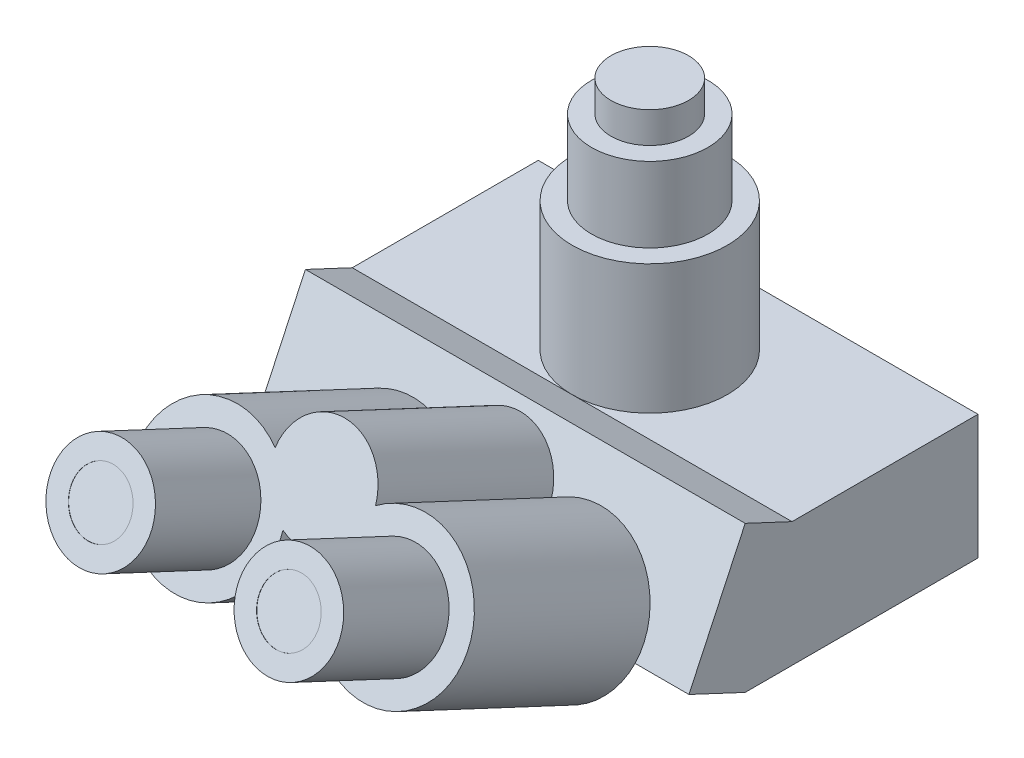
ISO-10303-21;
HEADER;
FILE_DESCRIPTION(('STEP AP214'),'2;1');
FILE_NAME('part.step','',(''),(''),'','','');
FILE_SCHEMA(('AUTOMOTIVE_DESIGN { 1 0 10303 214 1 1 1 1 }'));
ENDSEC;
DATA;
#1=APPLICATION_CONTEXT('core data for automotive mechanical design processes');
#2=APPLICATION_PROTOCOL_DEFINITION('international standard','automotive_design',2000,#1);
#3=PRODUCT_CONTEXT('',#1,'mechanical');
#4=PRODUCT('Part','Part','',(#3));
#5=PRODUCT_RELATED_PRODUCT_CATEGORY('part','',(#4));
#6=PRODUCT_DEFINITION_FORMATION('','',#4);
#7=PRODUCT_DEFINITION_CONTEXT('part definition',#1,'design');
#8=PRODUCT_DEFINITION('design','',#6,#7);
#9=PRODUCT_DEFINITION_SHAPE('','',#8);
#10=(LENGTH_UNIT() NAMED_UNIT(*) SI_UNIT(.MILLI.,.METRE.));
#11=(NAMED_UNIT(*) PLANE_ANGLE_UNIT() SI_UNIT($,.RADIAN.));
#12=(NAMED_UNIT(*) SI_UNIT($,.STERADIAN.) SOLID_ANGLE_UNIT());
#13=UNCERTAINTY_MEASURE_WITH_UNIT(LENGTH_MEASURE(1.E-05),#10,'distance_accuracy_value','');
#14=(GEOMETRIC_REPRESENTATION_CONTEXT(3) GLOBAL_UNCERTAINTY_ASSIGNED_CONTEXT((#13)) GLOBAL_UNIT_ASSIGNED_CONTEXT((#10,
#11,#12)) REPRESENTATION_CONTEXT('',''));
#15=CARTESIAN_POINT('',(0.,0.,0.));
#16=DIRECTION('',(0.,0.,1.));
#17=DIRECTION('',(1.,0.,0.));
#18=AXIS2_PLACEMENT_3D('',#15,#16,#17);
#19=CARTESIAN_POINT('',(-18.1865334794783,57.1587664374847,82.5526690406383));
#20=DIRECTION('',(0.,0.423992010428259,0.905665929078158));
#21=DIRECTION('',(0.,-0.905665929078158,0.423992010428259));
#22=AXIS2_PLACEMENT_3D('',#19,#20,#21);
#23=PLANE('',#22);
#24=CARTESIAN_POINT('',(36.3730669589503,47.6492741821735,87.0045851501307));
#25=DIRECTION('',(0.,0.423992010428259,0.905665929078158));
#26=DIRECTION('',(0.,-0.905665929078158,0.423992010428259));
#27=AXIS2_PLACEMENT_3D('',#24,#25,#26);
#28=CIRCLE('',#27,19.5);
#29=CARTESIAN_POINT('',(36.3730669589503,29.9887885651495,95.2724293534817));
#30=VERTEX_POINT('',#29);
#31=EDGE_CURVE('E284',#30,#30,#28,.T.);
#32=ORIENTED_EDGE('',*,*,#31,.F.);
#33=EDGE_LOOP('',(#32));
#34=FACE_BOUND('',#33,.T.);
#35=CARTESIAN_POINT('',(-36.3730669589422,47.6492741821607,87.0045851501366));
#36=DIRECTION('',(0.,0.423992010428259,0.905665929078158));
#37=DIRECTION('',(0.,-0.905665929078158,0.423992010428259));
#38=AXIS2_PLACEMENT_3D('',#35,#36,#37);
#39=CIRCLE('',#38,28.5);
#40=CARTESIAN_POINT('',(-19.4072154072409,68.3890216073841,77.2951692118057));
#41=VERTEX_POINT('',#40);
#42=CARTESIAN_POINT('',(-8.0581616842069,50.58622175999,85.6296385301244));
#43=VERTEX_POINT('',#42);
#44=EDGE_CURVE('E148',#41,#43,#39,.T.);
#45=ORIENTED_EDGE('',*,*,#44,.T.);
#46=CARTESIAN_POINT('',(-1.45543299634454E-11,66.6682586928087,78.1007529311401));
#47=DIRECTION('',(0.,0.423992010428259,0.905665929078158));
#48=DIRECTION('',(0.,-0.905665929078158,0.423992010428259));
#49=AXIS2_PLACEMENT_3D('',#46,#47,#48);
#50=CIRCLE('',#49,19.4999999999929);
#51=CARTESIAN_POINT('',(8.05816168421643,50.5862217600059,85.629638530117));
#52=VERTEX_POINT('',#51);
#53=EDGE_CURVE('E137',#43,#52,#50,.T.);
#54=ORIENTED_EDGE('',*,*,#53,.T.);
#55=CARTESIAN_POINT('',(36.3730669589503,47.6492741821735,87.0045851501306));
#56=DIRECTION('',(0.,0.423992010428259,0.905665929078158));
#57=DIRECTION('',(0.,-0.905665929078158,0.423992010428259));
#58=AXIS2_PLACEMENT_3D('',#55,#56,#57);
#59=CIRCLE('',#58,28.5000000000001);
#60=CARTESIAN_POINT('',(19.4072154072148,68.3890216073753,77.2951692118098));
#61=VERTEX_POINT('',#60);
#62=EDGE_CURVE('E147',#52,#61,#59,.T.);
#63=ORIENTED_EDGE('',*,*,#62,.T.);
#64=CARTESIAN_POINT('',(-1.45543299634454E-11,66.6682586928087,78.1007529311401));
#65=DIRECTION('',(0.,0.423992010428259,0.905665929078158));
#66=DIRECTION('',(0.,-0.905665929078158,0.423992010428259));
#67=AXIS2_PLACEMENT_3D('',#64,#65,#66);
#68=CIRCLE('',#67,19.4999999999876);
#69=EDGE_CURVE('E153',#61,#41,#68,.T.);
#70=ORIENTED_EDGE('',*,*,#69,.T.);
#71=EDGE_LOOP('',(#45,#54,#63,#70));
#72=FACE_BOUND('',#71,.T.);
#73=CARTESIAN_POINT('',(-36.3730669589422,47.6492741821607,87.0045851501367));
#74=DIRECTION('',(0.,0.423992010428259,0.905665929078158));
#75=DIRECTION('',(0.,-0.905665929078158,0.423992010428259));
#76=AXIS2_PLACEMENT_3D('',#73,#74,#75);
#77=CIRCLE('',#76,19.5);
#78=CARTESIAN_POINT('',(-36.3730669589422,29.9887885651366,95.2724293534877));
#79=VERTEX_POINT('',#78);
#80=EDGE_CURVE('E11',#79,#79,#77,.T.);
#81=ORIENTED_EDGE('',*,*,#80,.F.);
#82=EDGE_LOOP('',(#81));
#83=FACE_BOUND('',#82,.T.);
#84=ADVANCED_FACE('F45',(#34,#72,#83),#23,.T.);
#85=CARTESIAN_POINT('',(85.,56.6048402085651,0.));
#86=DIRECTION('',(0.,-0.423992010428259,-0.905665929078158));
#87=DIRECTION('',(0.,0.905665929078158,-0.423992010428259));
#88=AXIS2_PLACEMENT_3D('',#85,#86,#87);
#89=PLANE('',#88);
#90=CARTESIAN_POINT('',(-36.3730669589422,15.8498734000413,19.0796404692748));
#91=DIRECTION('',(0.,0.423992010428259,0.905665929078158));
#92=DIRECTION('',(0.,-0.905665929078158,0.423992010428259));
#93=AXIS2_PLACEMENT_3D('',#90,#91,#92);
#94=CIRCLE('',#93,28.5);
#95=CARTESIAN_POINT('',(-19.4072154072409,36.5896208252646,9.37022453094387));
#96=VERTEX_POINT('',#95);
#97=CARTESIAN_POINT('',(-64.1759235166031,10.1758082502781,21.7359822978757));
#98=VERTEX_POINT('',#97);
#99=EDGE_CURVE('E62',#96,#98,#94,.T.);
#100=ORIENTED_EDGE('',*,*,#99,.F.);
#101=CARTESIAN_POINT('',(-1.45543299634454E-11,34.8688579106893,10.1758082502782));
#102=DIRECTION('',(0.,0.423992010428259,0.905665929078158));
#103=DIRECTION('',(0.,-0.905665929078158,0.423992010428259));
#104=AXIS2_PLACEMENT_3D('',#101,#102,#103);
#105=CIRCLE('',#104,19.4999999999876);
#106=CARTESIAN_POINT('',(19.4072154072148,36.5896208252558,9.37022453094798));
#107=VERTEX_POINT('',#106);
#108=EDGE_CURVE('E66',#107,#96,#105,.T.);
#109=ORIENTED_EDGE('',*,*,#108,.F.);
#110=CARTESIAN_POINT('',(36.3730669589503,15.8498734000541,19.0796404692688));
#111=DIRECTION('',(0.,0.423992010428259,0.905665929078158));
#112=DIRECTION('',(0.,-0.905665929078158,0.423992010428259));
#113=AXIS2_PLACEMENT_3D('',#110,#111,#112);
#114=CIRCLE('',#113,28.5000000000001);
#115=CARTESIAN_POINT('',(64.1759235166082,10.1758082502781,21.7359822978757));
#116=VERTEX_POINT('',#115);
#117=EDGE_CURVE('E54',#116,#107,#114,.T.);
#118=ORIENTED_EDGE('',*,*,#117,.F.);
#119=DIRECTION('',(-1.,0.,0.));
#120=VECTOR('',#119,1.);
#121=CARTESIAN_POINT('',(85.,10.1758082502781,21.7359822978757));
#122=LINE('',#121,#120);
#123=CARTESIAN_POINT('',(85.,10.1758082502781,21.7359822978757));
#124=VERTEX_POINT('',#123);
#125=EDGE_CURVE('E214',#124,#116,#122,.T.);
#126=ORIENTED_EDGE('',*,*,#125,.F.);
#127=DIRECTION('',(0.,-0.905665929078158,0.423992010428259));
#128=VECTOR('',#127,1.);
#129=CARTESIAN_POINT('',(85.,56.6048402085651,0.));
#130=LINE('',#129,#128);
#131=CARTESIAN_POINT('',(85.,56.6048402085651,0.));
#132=VERTEX_POINT('',#131);
#133=EDGE_CURVE('E198',#132,#124,#130,.T.);
#134=ORIENTED_EDGE('',*,*,#133,.F.);
#135=DIRECTION('',(-1.,0.,0.));
#136=VECTOR('',#135,1.);
#137=CARTESIAN_POINT('',(85.,56.6048402085651,0.));
#138=LINE('',#137,#136);
#139=CARTESIAN_POINT('',(-85.,56.6048402085651,0.));
#140=VERTEX_POINT('',#139);
#141=EDGE_CURVE('E217',#132,#140,#138,.T.);
#142=ORIENTED_EDGE('',*,*,#141,.T.);
#143=DIRECTION('',(0.,-0.905665929078158,0.423992010428259));
#144=VECTOR('',#143,1.);
#145=CARTESIAN_POINT('',(-85.,56.6048402085651,0.));
#146=LINE('',#145,#144);
#147=CARTESIAN_POINT('',(-85.,10.1758082502781,21.7359822978757));
#148=VERTEX_POINT('',#147);
#149=EDGE_CURVE('E190',#140,#148,#146,.T.);
#150=ORIENTED_EDGE('',*,*,#149,.T.);
#151=EDGE_CURVE('E200',#98,#148,#122,.T.);
#152=ORIENTED_EDGE('',*,*,#151,.F.);
#153=EDGE_LOOP('',(#100,#109,#118,#126,#134,#142,#150,#152));
#154=FACE_BOUND('',#153,.T.);
#155=ADVANCED_FACE('F314',(#154),#89,.F.);
#156=CARTESIAN_POINT('',(85.,10.1758082502781,21.7359822978757));
#157=DIRECTION('',(0.,0.905665929078159,-0.423992010428257));
#158=DIRECTION('',(0.,0.423992010428257,0.905665929078159));
#159=AXIS2_PLACEMENT_3D('',#156,#157,#158);
#160=PLANE('',#159);
#161=DIRECTION('',(0.,-0.423992010428257,-0.905665929078159));
#162=VECTOR('',#161,1.);
#163=CARTESIAN_POINT('',(-85.,10.1758082502781,21.7359822978757));
#164=LINE('',#163,#162);
#165=CARTESIAN_POINT('',(-85.,0.,0.));
#166=VERTEX_POINT('',#165);
#167=EDGE_CURVE('E183',#148,#166,#164,.T.);
#168=ORIENTED_EDGE('',*,*,#167,.T.);
#169=DIRECTION('',(-1.,0.,0.));
#170=VECTOR('',#169,1.);
#171=CARTESIAN_POINT('',(85.,0.,0.));
#172=LINE('',#171,#170);
#173=CARTESIAN_POINT('',(85.,0.,0.));
#174=VERTEX_POINT('',#173);
#175=EDGE_CURVE('E49',#174,#166,#172,.T.);
#176=ORIENTED_EDGE('',*,*,#175,.F.);
#177=DIRECTION('',(0.,-0.423992010428257,-0.905665929078159));
#178=VECTOR('',#177,1.);
#179=CARTESIAN_POINT('',(85.,10.1758082502781,21.7359822978757));
#180=LINE('',#179,#178);
#181=EDGE_CURVE('E186',#124,#174,#180,.T.);
#182=ORIENTED_EDGE('',*,*,#181,.F.);
#183=ORIENTED_EDGE('',*,*,#125,.T.);
#184=CARTESIAN_POINT('',(8.57021040129247,10.1758082502781,21.7359822978757));
#185=VERTEX_POINT('',#184);
#186=EDGE_CURVE('E218',#116,#185,#122,.T.);
#187=ORIENTED_EDGE('',*,*,#186,.T.);
#188=CARTESIAN_POINT('',(-8.57021040128124,10.1758082502781,21.7359822978757));
#189=VERTEX_POINT('',#188);
#190=EDGE_CURVE('E268',#185,#189,#122,.T.);
#191=ORIENTED_EDGE('',*,*,#190,.T.);
#192=EDGE_CURVE('E637',#189,#98,#122,.T.);
#193=ORIENTED_EDGE('',*,*,#192,.T.);
#194=ORIENTED_EDGE('',*,*,#151,.T.);
#195=EDGE_LOOP('',(#168,#176,#182,#183,#187,#191,#193,#194));
#196=FACE_BOUND('',#195,.T.);
#197=ADVANCED_FACE('F47',(#196),#160,.F.);
#198=CARTESIAN_POINT('',(85.,0.,0.));
#199=DIRECTION('',(0.,1.,0.));
#200=DIRECTION('',(0.,0.,1.));
#201=AXIS2_PLACEMENT_3D('',#198,#199,#200);
#202=PLANE('',#201);
#203=DIRECTION('',(0.,0.,-1.));
#204=VECTOR('',#203,1.);
#205=CARTESIAN_POINT('',(-85.,0.,0.));
#206=LINE('',#205,#204);
#207=CARTESIAN_POINT('',(-85.,0.,-90.));
#208=VERTEX_POINT('',#207);
#209=EDGE_CURVE('E203',#166,#208,#206,.T.);
#210=ORIENTED_EDGE('',*,*,#209,.T.);
#211=DIRECTION('',(-1.,0.,0.));
#212=VECTOR('',#211,1.);
#213=CARTESIAN_POINT('',(85.,0.,-90.));
#214=LINE('',#213,#212);
#215=CARTESIAN_POINT('',(85.,0.,-90.));
#216=VERTEX_POINT('',#215);
#217=EDGE_CURVE('E226',#216,#208,#214,.T.);
#218=ORIENTED_EDGE('',*,*,#217,.F.);
#219=DIRECTION('',(0.,0.,-1.));
#220=VECTOR('',#219,1.);
#221=CARTESIAN_POINT('',(85.,0.,0.));
#222=LINE('',#221,#220);
#223=EDGE_CURVE('E189',#174,#216,#222,.T.);
#224=ORIENTED_EDGE('',*,*,#223,.F.);
#225=ORIENTED_EDGE('',*,*,#175,.T.);
#226=EDGE_LOOP('',(#210,#218,#224,#225));
#227=FACE_BOUND('',#226,.T.);
#228=ADVANCED_FACE('F235',(#227),#202,.F.);
#229=CARTESIAN_POINT('',(85.,0.,-90.));
#230=DIRECTION('',(0.,0.,1.));
#231=DIRECTION('',(1.,0.,0.));
#232=AXIS2_PLACEMENT_3D('',#229,#230,#231);
#233=PLANE('',#232);
#234=DIRECTION('',(0.,1.,0.));
#235=VECTOR('',#234,1.);
#236=CARTESIAN_POINT('',(-85.,0.,-90.));
#237=LINE('',#236,#235);
#238=CARTESIAN_POINT('',(-85.,48.125,-90.));
#239=VERTEX_POINT('',#238);
#240=EDGE_CURVE('E205',#208,#239,#237,.T.);
#241=ORIENTED_EDGE('',*,*,#240,.T.);
#242=DIRECTION('',(-1.,0.,0.));
#243=VECTOR('',#242,1.);
#244=CARTESIAN_POINT('',(85.,48.125,-90.));
#245=LINE('',#244,#243);
#246=CARTESIAN_POINT('',(85.,48.125,-90.));
#247=VERTEX_POINT('',#246);
#248=EDGE_CURVE('E224',#247,#239,#245,.T.);
#249=ORIENTED_EDGE('',*,*,#248,.F.);
#250=DIRECTION('',(0.,1.,0.));
#251=VECTOR('',#250,1.);
#252=CARTESIAN_POINT('',(85.,0.,-90.));
#253=LINE('',#252,#251);
#254=EDGE_CURVE('E192',#216,#247,#253,.T.);
#255=ORIENTED_EDGE('',*,*,#254,.F.);
#256=ORIENTED_EDGE('',*,*,#217,.T.);
#257=EDGE_LOOP('',(#241,#249,#255,#256));
#258=FACE_BOUND('',#257,.T.);
#259=ADVANCED_FACE('F246',(#258),#233,.F.);
#260=CARTESIAN_POINT('',(85.,48.125,-90.));
#261=DIRECTION('',(0.,-1.,0.));
#262=DIRECTION('',(0.,0.,-1.));
#263=AXIS2_PLACEMENT_3D('',#260,#261,#262);
#264=PLANE('',#263);
#265=DIRECTION('',(-1.,0.,0.));
#266=VECTOR('',#265,1.);
#267=CARTESIAN_POINT('',(85.,48.125,-18.1133185815631));
#268=LINE('',#267,#266);
#269=CARTESIAN_POINT('',(0.,48.125,-18.1133185815631));
#270=VERTEX_POINT('',#269);
#271=CARTESIAN_POINT('',(-85.,48.125,-18.1133185815631));
#272=VERTEX_POINT('',#271);
#273=EDGE_CURVE('E221',#270,#272,#268,.T.);
#274=ORIENTED_EDGE('',*,*,#273,.F.);
#275=CARTESIAN_POINT('',(0.,48.125,-48.1133185815631));
#276=DIRECTION('',(0.,1.,0.));
#277=DIRECTION('',(0.,0.,1.));
#278=AXIS2_PLACEMENT_3D('',#275,#276,#277);
#279=CIRCLE('',#278,30.);
#280=EDGE_CURVE('E177',#270,#270,#279,.T.);
#281=ORIENTED_EDGE('',*,*,#280,.F.);
#282=CARTESIAN_POINT('',(85.,48.125,-18.1133185815631));
#283=VERTEX_POINT('',#282);
#284=EDGE_CURVE('E222',#283,#270,#268,.T.);
#285=ORIENTED_EDGE('',*,*,#284,.F.);
#286=DIRECTION('',(0.,0.,1.));
#287=VECTOR('',#286,1.);
#288=CARTESIAN_POINT('',(85.,48.125,-90.));
#289=LINE('',#288,#287);
#290=EDGE_CURVE('E194',#247,#283,#289,.T.);
#291=ORIENTED_EDGE('',*,*,#290,.F.);
#292=ORIENTED_EDGE('',*,*,#248,.T.);
#293=DIRECTION('',(0.,0.,1.));
#294=VECTOR('',#293,1.);
#295=CARTESIAN_POINT('',(-85.,48.125,-90.));
#296=LINE('',#295,#294);
#297=EDGE_CURVE('E207',#239,#272,#296,.T.);
#298=ORIENTED_EDGE('',*,*,#297,.T.);
#299=EDGE_LOOP('',(#274,#281,#285,#291,#292,#298));
#300=FACE_BOUND('',#299,.T.);
#301=ADVANCED_FACE('F250',(#300),#264,.F.);
#302=CARTESIAN_POINT('',(85.,48.125,-18.1133185815631));
#303=DIRECTION('',(0.,-0.905665929078159,0.423992010428257));
#304=DIRECTION('',(0.,-0.423992010428257,-0.905665929078159));
#305=AXIS2_PLACEMENT_3D('',#302,#303,#304);
#306=PLANE('',#305);
#307=DIRECTION('',(0.,0.423992010428257,0.905665929078159));
#308=VECTOR('',#307,1.);
#309=CARTESIAN_POINT('',(-85.,48.125,-18.1133185815631));
#310=LINE('',#309,#308);
#311=EDGE_CURVE('E210',#272,#140,#310,.T.);
#312=ORIENTED_EDGE('',*,*,#311,.T.);
#313=ORIENTED_EDGE('',*,*,#141,.F.);
#314=DIRECTION('',(0.,0.423992010428257,0.905665929078159));
#315=VECTOR('',#314,1.);
#316=CARTESIAN_POINT('',(85.,48.125,-18.1133185815631));
#317=LINE('',#316,#315);
#318=EDGE_CURVE('E196',#283,#132,#317,.T.);
#319=ORIENTED_EDGE('',*,*,#318,.F.);
#320=ORIENTED_EDGE('',*,*,#284,.T.);
#321=ORIENTED_EDGE('',*,*,#273,.T.);
#322=EDGE_LOOP('',(#312,#313,#319,#320,#321));
#323=FACE_BOUND('',#322,.T.);
#324=ADVANCED_FACE('F567',(#323),#306,.F.);
#325=CARTESIAN_POINT('',(-8.0581616842069,18.7868209778706,17.7046938492626));
#326=VERTEX_POINT('',#325);
#327=EDGE_CURVE('E161',#189,#326,#94,.T.);
#328=ORIENTED_EDGE('',*,*,#327,.F.);
#329=ORIENTED_EDGE('',*,*,#190,.F.);
#330=CARTESIAN_POINT('',(8.05816168421643,18.7868209778865,17.7046938492551));
#331=VERTEX_POINT('',#330);
#332=EDGE_CURVE('E273',#331,#185,#114,.T.);
#333=ORIENTED_EDGE('',*,*,#332,.F.);
#334=CARTESIAN_POINT('',(-1.45543299634454E-11,34.8688579106893,10.1758082502782));
#335=DIRECTION('',(0.,0.423992010428259,0.905665929078158));
#336=DIRECTION('',(0.,-0.905665929078158,0.423992010428259));
#337=AXIS2_PLACEMENT_3D('',#334,#335,#336);
#338=CIRCLE('',#337,19.4999999999929);
#339=EDGE_CURVE('E274',#326,#331,#338,.T.);
#340=ORIENTED_EDGE('',*,*,#339,.F.);
#341=EDGE_LOOP('',(#328,#329,#333,#340));
#342=FACE_BOUND('',#341,.T.);
#343=ADVANCED_FACE('F322',(#342),#89,.F.);
#344=CARTESIAN_POINT('',(85.,0.,0.));
#345=DIRECTION('',(-1.,0.,0.));
#346=DIRECTION('',(0.,0.,1.));
#347=AXIS2_PLACEMENT_3D('',#344,#345,#346);
#348=PLANE('',#347);
#349=ORIENTED_EDGE('',*,*,#181,.T.);
#350=ORIENTED_EDGE('',*,*,#223,.T.);
#351=ORIENTED_EDGE('',*,*,#254,.T.);
#352=ORIENTED_EDGE('',*,*,#290,.T.);
#353=ORIENTED_EDGE('',*,*,#318,.T.);
#354=ORIENTED_EDGE('',*,*,#133,.T.);
#355=EDGE_LOOP('',(#349,#350,#351,#352,#353,#354));
#356=FACE_BOUND('',#355,.T.);
#357=ADVANCED_FACE('F255',(#356),#348,.F.);
#358=CARTESIAN_POINT('',(-85.,0.,0.));
#359=DIRECTION('',(-1.,0.,0.));
#360=DIRECTION('',(0.,0.,1.));
#361=AXIS2_PLACEMENT_3D('',#358,#359,#360);
#362=PLANE('',#361);
#363=ORIENTED_EDGE('',*,*,#167,.F.);
#364=ORIENTED_EDGE('',*,*,#149,.F.);
#365=ORIENTED_EDGE('',*,*,#311,.F.);
#366=ORIENTED_EDGE('',*,*,#297,.F.);
#367=ORIENTED_EDGE('',*,*,#240,.F.);
#368=ORIENTED_EDGE('',*,*,#209,.F.);
#369=EDGE_LOOP('',(#363,#364,#365,#366,#367,#368));
#370=FACE_BOUND('',#369,.T.);
#371=ADVANCED_FACE('F242',(#370),#362,.T.);
#372=CARTESIAN_POINT('',(0.,98.125,-48.1133185815631));
#373=DIRECTION('',(0.,-1.,0.));
#374=DIRECTION('',(0.,0.,-1.));
#375=AXIS2_PLACEMENT_3D('',#372,#373,#374);
#376=CYLINDRICAL_SURFACE('',#375,30.);
#377=CARTESIAN_POINT('',(0.,98.125,-48.1133185815631));
#378=DIRECTION('',(0.,1.,0.));
#379=DIRECTION('',(0.,0.,1.));
#380=AXIS2_PLACEMENT_3D('',#377,#378,#379);
#381=CIRCLE('',#380,30.);
#382=CARTESIAN_POINT('',(0.,98.125,-18.1133185815631));
#383=VERTEX_POINT('',#382);
#384=EDGE_CURVE('E180',#383,#383,#381,.T.);
#385=ORIENTED_EDGE('',*,*,#384,.F.);
#386=EDGE_LOOP('',(#385));
#387=FACE_BOUND('',#386,.T.);
#388=ORIENTED_EDGE('',*,*,#280,.T.);
#389=EDGE_LOOP('',(#388));
#390=FACE_BOUND('',#389,.T.);
#391=ADVANCED_FACE('F527',(#387,#390),#376,.T.);
#392=CARTESIAN_POINT('',(0.,98.125,-48.1133185815631));
#393=DIRECTION('',(0.,1.,0.));
#394=DIRECTION('',(0.,0.,1.));
#395=AXIS2_PLACEMENT_3D('',#392,#393,#394);
#396=PLANE('',#395);
#397=CARTESIAN_POINT('',(0.,98.125,-48.1133185815631));
#398=DIRECTION('',(0.,1.,0.));
#399=DIRECTION('',(0.,0.,1.));
#400=AXIS2_PLACEMENT_3D('',#397,#398,#399);
#401=CIRCLE('',#400,22.5);
#402=CARTESIAN_POINT('',(0.,98.125,-25.6133185815631));
#403=VERTEX_POINT('',#402);
#404=EDGE_CURVE('E174',#403,#403,#401,.T.);
#405=ORIENTED_EDGE('',*,*,#404,.F.);
#406=EDGE_LOOP('',(#405));
#407=FACE_BOUND('',#406,.T.);
#408=ORIENTED_EDGE('',*,*,#384,.T.);
#409=EDGE_LOOP('',(#408));
#410=FACE_BOUND('',#409,.T.);
#411=ADVANCED_FACE('F517',(#407,#410),#396,.T.);
#412=CARTESIAN_POINT('',(0.,127.125,-48.1133185815631));
#413=DIRECTION('',(0.,-1.,0.));
#414=DIRECTION('',(0.,0.,-1.));
#415=AXIS2_PLACEMENT_3D('',#412,#413,#414);
#416=CYLINDRICAL_SURFACE('',#415,22.5);
#417=CARTESIAN_POINT('',(0.,127.125,-48.1133185815631));
#418=DIRECTION('',(0.,1.,0.));
#419=DIRECTION('',(0.,0.,1.));
#420=AXIS2_PLACEMENT_3D('',#417,#418,#419);
#421=CIRCLE('',#420,22.5);
#422=CARTESIAN_POINT('',(0.,127.125,-25.6133185815631));
#423=VERTEX_POINT('',#422);
#424=EDGE_CURVE('E165',#423,#423,#421,.T.);
#425=ORIENTED_EDGE('',*,*,#424,.F.);
#426=EDGE_LOOP('',(#425));
#427=FACE_BOUND('',#426,.T.);
#428=ORIENTED_EDGE('',*,*,#404,.T.);
#429=EDGE_LOOP('',(#428));
#430=FACE_BOUND('',#429,.T.);
#431=ADVANCED_FACE('F507',(#427,#430),#416,.T.);
#432=CARTESIAN_POINT('',(0.,127.125,-48.1133185815631));
#433=DIRECTION('',(0.,1.,0.));
#434=DIRECTION('',(0.,0.,1.));
#435=AXIS2_PLACEMENT_3D('',#432,#433,#434);
#436=PLANE('',#435);
#437=CARTESIAN_POINT('',(0.,127.125,-48.1133185815631));
#438=DIRECTION('',(0.,1.,0.));
#439=DIRECTION('',(0.,0.,1.));
#440=AXIS2_PLACEMENT_3D('',#437,#438,#439);
#441=CIRCLE('',#440,15.);
#442=CARTESIAN_POINT('',(0.,127.125,-33.1133185815631));
#443=VERTEX_POINT('',#442);
#444=EDGE_CURVE('E171',#443,#443,#441,.T.);
#445=ORIENTED_EDGE('',*,*,#444,.F.);
#446=EDGE_LOOP('',(#445));
#447=FACE_BOUND('',#446,.T.);
#448=ORIENTED_EDGE('',*,*,#424,.T.);
#449=EDGE_LOOP('',(#448));
#450=FACE_BOUND('',#449,.T.);
#451=ADVANCED_FACE('F497',(#447,#450),#436,.T.);
#452=CARTESIAN_POINT('',(0.,139.125,-48.1133185815631));
#453=DIRECTION('',(0.,-1.,0.));
#454=DIRECTION('',(0.,0.,-1.));
#455=AXIS2_PLACEMENT_3D('',#452,#453,#454);
#456=CYLINDRICAL_SURFACE('',#455,15.);
#457=CARTESIAN_POINT('',(0.,139.125,-48.1133185815631));
#458=DIRECTION('',(0.,1.,0.));
#459=DIRECTION('',(0.,0.,1.));
#460=AXIS2_PLACEMENT_3D('',#457,#458,#459);
#461=CIRCLE('',#460,15.);
#462=CARTESIAN_POINT('',(0.,139.125,-33.1133185815631));
#463=VERTEX_POINT('',#462);
#464=EDGE_CURVE('E162',#463,#463,#461,.T.);
#465=ORIENTED_EDGE('',*,*,#464,.F.);
#466=EDGE_LOOP('',(#465));
#467=FACE_BOUND('',#466,.T.);
#468=ORIENTED_EDGE('',*,*,#444,.T.);
#469=EDGE_LOOP('',(#468));
#470=FACE_BOUND('',#469,.T.);
#471=ADVANCED_FACE('F487',(#467,#470),#456,.T.);
#472=CARTESIAN_POINT('',(0.,139.125,-48.1133185815631));
#473=DIRECTION('',(0.,1.,0.));
#474=DIRECTION('',(0.,0.,1.));
#475=AXIS2_PLACEMENT_3D('',#472,#473,#474);
#476=PLANE('',#475);
#477=ORIENTED_EDGE('',*,*,#464,.T.);
#478=EDGE_LOOP('',(#477));
#479=FACE_BOUND('',#478,.T.);
#480=ADVANCED_FACE('F472',(#479),#476,.T.);
#481=CARTESIAN_POINT('',(-18.1865334794783,25.3593656553653,14.6277243597765));
#482=DIRECTION('',(0.,0.423992010428259,0.905665929078158));
#483=DIRECTION('',(0.,-0.905665929078158,0.423992010428259));
#484=AXIS2_PLACEMENT_3D('',#481,#482,#483);
#485=PLANE('',#484);
#486=ORIENTED_EDGE('',*,*,#186,.F.);
#487=EDGE_CURVE('E266',#185,#116,#114,.T.);
#488=ORIENTED_EDGE('',*,*,#487,.F.);
#489=EDGE_LOOP('',(#486,#488));
#490=FACE_BOUND('',#489,.T.);
#491=ADVANCED_FACE('F265',(#490),#485,.F.);
#492=CARTESIAN_POINT('',(-36.3730669589422,47.6492741821607,87.0045851501366));
#493=DIRECTION('',(0.,-0.423992010428259,-0.905665929078158));
#494=DIRECTION('',(0.,0.905665929078158,-0.423992010428259));
#495=AXIS2_PLACEMENT_3D('',#492,#493,#494);
#496=CYLINDRICAL_SURFACE('',#495,28.5);
#497=ORIENTED_EDGE('',*,*,#99,.T.);
#498=EDGE_CURVE('E279',#98,#189,#94,.T.);
#499=ORIENTED_EDGE('',*,*,#498,.T.);
#500=ORIENTED_EDGE('',*,*,#327,.T.);
#501=DIRECTION('',(0.,-0.423992010428259,-0.905665929078158));
#502=VECTOR('',#501,1.);
#503=CARTESIAN_POINT('',(-8.0581616842069,50.58622175999,85.6296385301244));
#504=LINE('',#503,#502);
#505=EDGE_CURVE('E142',#43,#326,#504,.T.);
#506=ORIENTED_EDGE('',*,*,#505,.F.);
#507=ORIENTED_EDGE('',*,*,#44,.F.);
#508=DIRECTION('',(0.,-0.423992010428259,-0.905665929078158));
#509=VECTOR('',#508,1.);
#510=CARTESIAN_POINT('',(-19.4072154072409,68.3890216073841,77.2951692118057));
#511=LINE('',#510,#509);
#512=EDGE_CURVE('E298',#41,#96,#511,.T.);
#513=ORIENTED_EDGE('',*,*,#512,.T.);
#514=EDGE_LOOP('',(#497,#499,#500,#506,#507,#513));
#515=FACE_BOUND('',#514,.T.);
#516=ADVANCED_FACE('F159',(#515),#496,.T.);
#517=CARTESIAN_POINT('',(-1.45543299634454E-11,66.6682586928087,78.1007529311401));
#518=DIRECTION('',(0.,-0.423992010428259,-0.905665929078158));
#519=DIRECTION('',(0.,0.905665929078158,-0.423992010428259));
#520=AXIS2_PLACEMENT_3D('',#517,#518,#519);
#521=CYLINDRICAL_SURFACE('',#520,19.4999999999929);
#522=ORIENTED_EDGE('',*,*,#339,.T.);
#523=DIRECTION('',(0.,-0.423992010428259,-0.905665929078158));
#524=VECTOR('',#523,1.);
#525=CARTESIAN_POINT('',(8.05816168421643,50.5862217600059,85.629638530117));
#526=LINE('',#525,#524);
#527=EDGE_CURVE('E144',#52,#331,#526,.T.);
#528=ORIENTED_EDGE('',*,*,#527,.F.);
#529=ORIENTED_EDGE('',*,*,#53,.F.);
#530=ORIENTED_EDGE('',*,*,#505,.T.);
#531=EDGE_LOOP('',(#522,#528,#529,#530));
#532=FACE_BOUND('',#531,.T.);
#533=ADVANCED_FACE('F140',(#532),#521,.T.);
#534=CARTESIAN_POINT('',(36.3730669589503,47.6492741821735,87.0045851501306));
#535=DIRECTION('',(0.,-0.423992010428259,-0.905665929078158));
#536=DIRECTION('',(0.,0.905665929078158,-0.423992010428259));
#537=AXIS2_PLACEMENT_3D('',#534,#535,#536);
#538=CYLINDRICAL_SURFACE('',#537,28.5000000000001);
#539=ORIENTED_EDGE('',*,*,#332,.T.);
#540=ORIENTED_EDGE('',*,*,#487,.T.);
#541=ORIENTED_EDGE('',*,*,#117,.T.);
#542=DIRECTION('',(0.,-0.423992010428259,-0.905665929078158));
#543=VECTOR('',#542,1.);
#544=CARTESIAN_POINT('',(19.4072154072148,68.3890216073753,77.2951692118098));
#545=LINE('',#544,#543);
#546=EDGE_CURVE('E167',#61,#107,#545,.T.);
#547=ORIENTED_EDGE('',*,*,#546,.F.);
#548=ORIENTED_EDGE('',*,*,#62,.F.);
#549=ORIENTED_EDGE('',*,*,#527,.T.);
#550=EDGE_LOOP('',(#539,#540,#541,#547,#548,#549));
#551=FACE_BOUND('',#550,.T.);
#552=ADVANCED_FACE('F270',(#551),#538,.T.);
#553=CARTESIAN_POINT('',(-1.45543299634454E-11,66.6682586928087,78.1007529311401));
#554=DIRECTION('',(0.,-0.423992010428259,-0.905665929078158));
#555=DIRECTION('',(0.,0.905665929078158,-0.423992010428259));
#556=AXIS2_PLACEMENT_3D('',#553,#554,#555);
#557=CYLINDRICAL_SURFACE('',#556,19.4999999999876);
#558=ORIENTED_EDGE('',*,*,#108,.T.);
#559=ORIENTED_EDGE('',*,*,#512,.F.);
#560=ORIENTED_EDGE('',*,*,#69,.F.);
#561=ORIENTED_EDGE('',*,*,#546,.T.);
#562=EDGE_LOOP('',(#558,#559,#560,#561));
#563=FACE_BOUND('',#562,.T.);
#564=ADVANCED_FACE('F301',(#563),#557,.T.);
#565=ORIENTED_EDGE('',*,*,#192,.F.);
#566=ORIENTED_EDGE('',*,*,#498,.F.);
#567=EDGE_LOOP('',(#565,#566));
#568=FACE_BOUND('',#567,.T.);
#569=ADVANCED_FACE('F303',(#568),#485,.F.);
#570=CARTESIAN_POINT('',(36.3730669589503,66.7289146514452,127.759551958648));
#571=DIRECTION('',(0.,-0.423992010428259,-0.905665929078158));
#572=DIRECTION('',(0.,0.905665929078158,-0.423992010428259));
#573=AXIS2_PLACEMENT_3D('',#570,#571,#572);
#574=CYLINDRICAL_SURFACE('',#573,19.5);
#575=CARTESIAN_POINT('',(36.3730669589503,66.7289146514452,127.759551958648));
#576=DIRECTION('',(0.,0.423992010428259,0.905665929078158));
#577=DIRECTION('',(0.,-0.905665929078158,0.423992010428259));
#578=AXIS2_PLACEMENT_3D('',#575,#576,#577);
#579=CIRCLE('',#578,19.5);
#580=CARTESIAN_POINT('',(36.3730669589503,49.0684290344211,136.027396161999));
#581=VERTEX_POINT('',#580);
#582=EDGE_CURVE('E289',#581,#581,#579,.T.);
#583=ORIENTED_EDGE('',*,*,#582,.F.);
#584=EDGE_LOOP('',(#583));
#585=FACE_BOUND('',#584,.T.);
#586=ORIENTED_EDGE('',*,*,#31,.T.);
#587=EDGE_LOOP('',(#586));
#588=FACE_BOUND('',#587,.T.);
#589=ADVANCED_FACE('F309',(#585,#588),#574,.T.);
#590=CARTESIAN_POINT('',(36.3730669589503,66.7289146514452,127.759551958648));
#591=DIRECTION('',(0.,0.423992010428259,0.905665929078158));
#592=DIRECTION('',(0.,-0.905665929078158,0.423992010428259));
#593=AXIS2_PLACEMENT_3D('',#590,#591,#592);
#594=PLANE('',#593);
#595=CARTESIAN_POINT('',(36.3730669589503,66.7289146514452,127.759551958648));
#596=DIRECTION('',(0.,0.423992010428259,0.905665929078158));
#597=DIRECTION('',(0.,-0.905665929078158,0.423992010428259));
#598=AXIS2_PLACEMENT_3D('',#595,#596,#597);
#599=CIRCLE('',#598,11.5);
#600=CARTESIAN_POINT('',(36.3730669589503,56.3137564670464,132.635460078573));
#601=VERTEX_POINT('',#600);
#602=EDGE_CURVE('E361',#601,#601,#599,.T.);
#603=ORIENTED_EDGE('',*,*,#602,.F.);
#604=EDGE_LOOP('',(#603));
#605=FACE_BOUND('',#604,.T.);
#606=ORIENTED_EDGE('',*,*,#582,.T.);
#607=EDGE_LOOP('',(#606));
#608=FACE_BOUND('',#607,.T.);
#609=ADVANCED_FACE('F325',(#605,#608),#594,.T.);
#610=CARTESIAN_POINT('',(-36.3730669589422,66.7289146514324,127.759551958654));
#611=DIRECTION('',(0.,-0.423992010428259,-0.905665929078158));
#612=DIRECTION('',(0.,0.905665929078158,-0.423992010428259));
#613=AXIS2_PLACEMENT_3D('',#610,#611,#612);
#614=CYLINDRICAL_SURFACE('',#613,19.5);
#615=CARTESIAN_POINT('',(-36.3730669589422,66.7289146514324,127.759551958654));
#616=DIRECTION('',(0.,0.423992010428259,0.905665929078158));
#617=DIRECTION('',(0.,-0.905665929078158,0.423992010428259));
#618=AXIS2_PLACEMENT_3D('',#615,#616,#617);
#619=CIRCLE('',#618,19.5);
#620=CARTESIAN_POINT('',(-36.3730669589422,49.0684290344083,136.027396162005));
#621=VERTEX_POINT('',#620);
#622=EDGE_CURVE('E281',#621,#621,#619,.T.);
#623=ORIENTED_EDGE('',*,*,#622,.F.);
#624=EDGE_LOOP('',(#623));
#625=FACE_BOUND('',#624,.T.);
#626=ORIENTED_EDGE('',*,*,#80,.T.);
#627=EDGE_LOOP('',(#626));
#628=FACE_BOUND('',#627,.T.);
#629=ADVANCED_FACE('F328',(#625,#628),#614,.T.);
#630=CARTESIAN_POINT('',(-36.3730669589422,66.7289146514324,127.759551958654));
#631=DIRECTION('',(0.,0.423992010428259,0.905665929078158));
#632=DIRECTION('',(0.,-0.905665929078158,0.423992010428259));
#633=AXIS2_PLACEMENT_3D('',#630,#631,#632);
#634=PLANE('',#633);
#635=CARTESIAN_POINT('',(-36.3730669589422,66.7289146514324,127.759551958654));
#636=DIRECTION('',(0.,0.423992010428259,0.905665929078158));
#637=DIRECTION('',(0.,-0.905665929078158,0.423992010428259));
#638=AXIS2_PLACEMENT_3D('',#635,#636,#637);
#639=CIRCLE('',#638,11.5);
#640=CARTESIAN_POINT('',(-36.3730669589422,56.3137564670336,132.635460078579));
#641=VERTEX_POINT('',#640);
#642=EDGE_CURVE('E358',#641,#641,#639,.T.);
#643=ORIENTED_EDGE('',*,*,#642,.F.);
#644=EDGE_LOOP('',(#643));
#645=FACE_BOUND('',#644,.T.);
#646=ORIENTED_EDGE('',*,*,#622,.T.);
#647=EDGE_LOOP('',(#646));
#648=FACE_BOUND('',#647,.T.);
#649=ADVANCED_FACE('F334',(#645,#648),#634,.T.);
#650=CARTESIAN_POINT('',(-36.3730669589422,66.6865154503896,127.668985365746));
#651=DIRECTION('',(0.,0.423992010428259,0.905665929078158));
#652=DIRECTION('',(0.,-0.905665929078158,0.423992010428259));
#653=AXIS2_PLACEMENT_3D('',#650,#651,#652);
#654=CYLINDRICAL_SURFACE('',#653,11.5);
#655=CARTESIAN_POINT('',(-36.3730669589422,66.6865154503896,127.668985365746));
#656=DIRECTION('',(0.,0.423992010428259,0.905665929078158));
#657=DIRECTION('',(0.,-0.905665929078158,0.423992010428259));
#658=AXIS2_PLACEMENT_3D('',#655,#656,#657);
#659=CIRCLE('',#658,11.5);
#660=CARTESIAN_POINT('',(-36.3730669589422,56.2713572659908,132.544893485671));
#661=VERTEX_POINT('',#660);
#662=EDGE_CURVE('E296',#661,#661,#659,.T.);
#663=ORIENTED_EDGE('',*,*,#662,.F.);
#664=EDGE_LOOP('',(#663));
#665=FACE_BOUND('',#664,.T.);
#666=ORIENTED_EDGE('',*,*,#642,.T.);
#667=EDGE_LOOP('',(#666));
#668=FACE_BOUND('',#667,.T.);
#669=ADVANCED_FACE('F338',(#665,#668),#654,.F.);
#670=CARTESIAN_POINT('',(-36.3730669589422,66.6865154503896,127.668985365746));
#671=DIRECTION('',(0.,0.423992010428259,0.905665929078158));
#672=DIRECTION('',(0.,-0.905665929078158,0.423992010428259));
#673=AXIS2_PLACEMENT_3D('',#670,#671,#672);
#674=PLANE('',#673);
#675=ORIENTED_EDGE('',*,*,#662,.T.);
#676=EDGE_LOOP('',(#675));
#677=FACE_BOUND('',#676,.T.);
#678=ADVANCED_FACE('F347',(#677),#674,.T.);
#679=CARTESIAN_POINT('',(36.3730669589503,66.6865154504024,127.66898536574));
#680=DIRECTION('',(0.,0.423992010428259,0.905665929078158));
#681=DIRECTION('',(0.,-0.905665929078158,0.423992010428259));
#682=AXIS2_PLACEMENT_3D('',#679,#680,#681);
#683=CYLINDRICAL_SURFACE('',#682,11.5);
#684=CARTESIAN_POINT('',(36.3730669589503,66.6865154504024,127.66898536574));
#685=DIRECTION('',(0.,0.423992010428259,0.905665929078158));
#686=DIRECTION('',(0.,-0.905665929078158,0.423992010428259));
#687=AXIS2_PLACEMENT_3D('',#684,#685,#686);
#688=CIRCLE('',#687,11.5);
#689=CARTESIAN_POINT('',(36.3730669589503,56.2713572660036,132.544893485665));
#690=VERTEX_POINT('',#689);
#691=EDGE_CURVE('E292',#690,#690,#688,.T.);
#692=ORIENTED_EDGE('',*,*,#691,.F.);
#693=EDGE_LOOP('',(#692));
#694=FACE_BOUND('',#693,.T.);
#695=ORIENTED_EDGE('',*,*,#602,.T.);
#696=EDGE_LOOP('',(#695));
#697=FACE_BOUND('',#696,.T.);
#698=ADVANCED_FACE('F343',(#694,#697),#683,.F.);
#699=CARTESIAN_POINT('',(36.3730669589503,66.6865154504024,127.66898536574));
#700=DIRECTION('',(0.,0.423992010428259,0.905665929078158));
#701=DIRECTION('',(0.,-0.905665929078158,0.423992010428259));
#702=AXIS2_PLACEMENT_3D('',#699,#700,#701);
#703=PLANE('',#702);
#704=ORIENTED_EDGE('',*,*,#691,.T.);
#705=EDGE_LOOP('',(#704));
#706=FACE_BOUND('',#705,.T.);
#707=ADVANCED_FACE('F340',(#706),#703,.T.);
#708=CLOSED_SHELL('',(#84,#155,#197,#228,#259,#301,#324,#343,#357,#371,#391,#411,#431,#451,#471,
#480,#491,#516,#533,#552,#564,#569,#589,#609,#629,#649,#669,#678,#698,#707));
#709=MANIFOLD_SOLID_BREP('B2',#708);
#710=ADVANCED_BREP_SHAPE_REPRESENTATION('',(#18,#709),#14);
#711=SHAPE_DEFINITION_REPRESENTATION(#9,#710);
ENDSEC;
END-ISO-10303-21;
